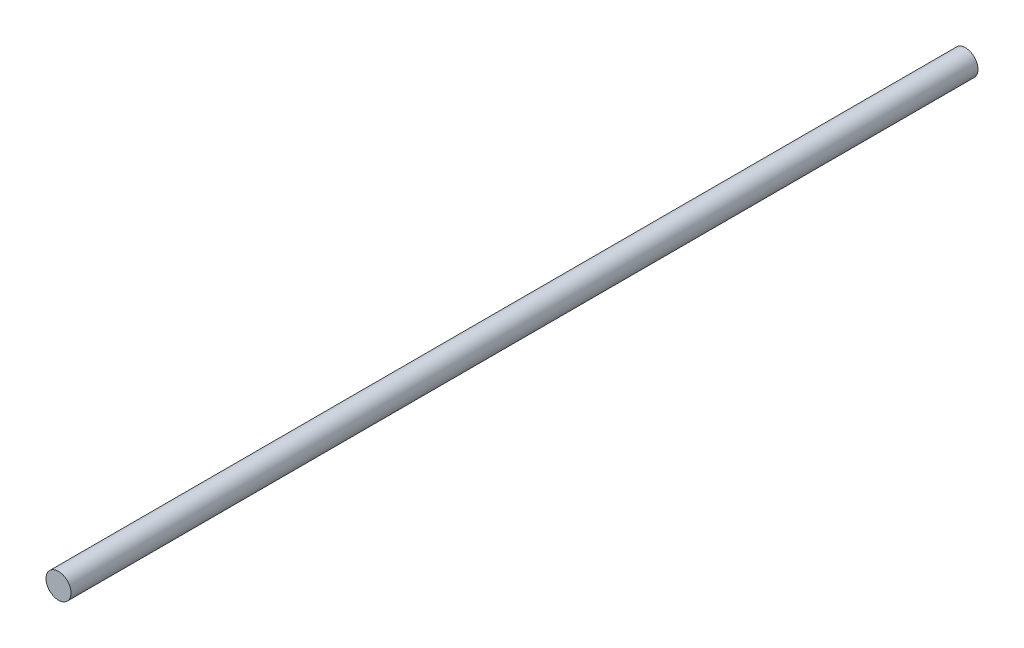
ISO-10303-21;
HEADER;
FILE_DESCRIPTION(('STEP AP214'),'2;1');
FILE_NAME('part.step','',(''),(''),'','','');
FILE_SCHEMA(('AUTOMOTIVE_DESIGN { 1 0 10303 214 1 1 1 1 }'));
ENDSEC;
DATA;
#1=APPLICATION_CONTEXT('core data for automotive mechanical design processes');
#2=APPLICATION_PROTOCOL_DEFINITION('international standard','automotive_design',2000,#1);
#3=PRODUCT_CONTEXT('',#1,'mechanical');
#4=PRODUCT('Part','Part','',(#3));
#5=PRODUCT_RELATED_PRODUCT_CATEGORY('part','',(#4));
#6=PRODUCT_DEFINITION_FORMATION('','',#4);
#7=PRODUCT_DEFINITION_CONTEXT('part definition',#1,'design');
#8=PRODUCT_DEFINITION('design','',#6,#7);
#9=PRODUCT_DEFINITION_SHAPE('','',#8);
#10=(LENGTH_UNIT() NAMED_UNIT(*) SI_UNIT(.MILLI.,.METRE.));
#11=(NAMED_UNIT(*) PLANE_ANGLE_UNIT() SI_UNIT($,.RADIAN.));
#12=(NAMED_UNIT(*) SI_UNIT($,.STERADIAN.) SOLID_ANGLE_UNIT());
#13=UNCERTAINTY_MEASURE_WITH_UNIT(LENGTH_MEASURE(1.E-05),#10,'distance_accuracy_value','');
#14=(GEOMETRIC_REPRESENTATION_CONTEXT(3) GLOBAL_UNCERTAINTY_ASSIGNED_CONTEXT((#13)) GLOBAL_UNIT_ASSIGNED_CONTEXT((#10,
#11,#12)) REPRESENTATION_CONTEXT('',''));
#15=CARTESIAN_POINT('',(0.,0.,0.));
#16=DIRECTION('',(0.,0.,1.));
#17=DIRECTION('',(1.,0.,0.));
#18=AXIS2_PLACEMENT_3D('',#15,#16,#17);
#19=CARTESIAN_POINT('',(0.,0.,290.));
#20=DIRECTION('',(0.,0.,-1.));
#21=DIRECTION('',(-1.,0.,0.));
#22=AXIS2_PLACEMENT_3D('',#19,#20,#21);
#23=CYLINDRICAL_SURFACE('',#22,4.);
#24=CARTESIAN_POINT('',(0.,0.,290.));
#25=DIRECTION('',(0.,0.,1.));
#26=DIRECTION('',(1.,0.,0.));
#27=AXIS2_PLACEMENT_3D('',#24,#25,#26);
#28=CIRCLE('',#27,4.);
#29=CARTESIAN_POINT('',(4.,0.,290.));
#30=VERTEX_POINT('',#29);
#31=EDGE_CURVE('E10',#30,#30,#28,.T.);
#32=ORIENTED_EDGE('',*,*,#31,.F.);
#33=EDGE_LOOP('',(#32));
#34=FACE_BOUND('',#33,.T.);
#35=CARTESIAN_POINT('',(0.,0.,0.));
#36=DIRECTION('',(0.,0.,1.));
#37=DIRECTION('',(1.,0.,0.));
#38=AXIS2_PLACEMENT_3D('',#35,#36,#37);
#39=CIRCLE('',#38,4.);
#40=CARTESIAN_POINT('',(4.,0.,0.));
#41=VERTEX_POINT('',#40);
#42=EDGE_CURVE('E37',#41,#41,#39,.T.);
#43=ORIENTED_EDGE('',*,*,#42,.T.);
#44=EDGE_LOOP('',(#43));
#45=FACE_BOUND('',#44,.T.);
#46=ADVANCED_FACE('F34',(#34,#45),#23,.T.);
#47=CARTESIAN_POINT('',(0.,0.,290.));
#48=DIRECTION('',(0.,0.,1.));
#49=DIRECTION('',(1.,0.,0.));
#50=AXIS2_PLACEMENT_3D('',#47,#48,#49);
#51=PLANE('',#50);
#52=ORIENTED_EDGE('',*,*,#31,.T.);
#53=EDGE_LOOP('',(#52));
#54=FACE_BOUND('',#53,.T.);
#55=ADVANCED_FACE('F49',(#54),#51,.T.);
#56=CARTESIAN_POINT('',(0.,0.,0.));
#57=DIRECTION('',(0.,0.,1.));
#58=DIRECTION('',(1.,0.,0.));
#59=AXIS2_PLACEMENT_3D('',#56,#57,#58);
#60=PLANE('',#59);
#61=ORIENTED_EDGE('',*,*,#42,.F.);
#62=EDGE_LOOP('',(#61));
#63=FACE_BOUND('',#62,.T.);
#64=ADVANCED_FACE('F47',(#63),#60,.F.);
#65=CLOSED_SHELL('',(#46,#55,#64));
#66=MANIFOLD_SOLID_BREP('B2',#65);
#67=ADVANCED_BREP_SHAPE_REPRESENTATION('',(#18,#66),#14);
#68=SHAPE_DEFINITION_REPRESENTATION(#9,#67);
ENDSEC;
END-ISO-10303-21;
